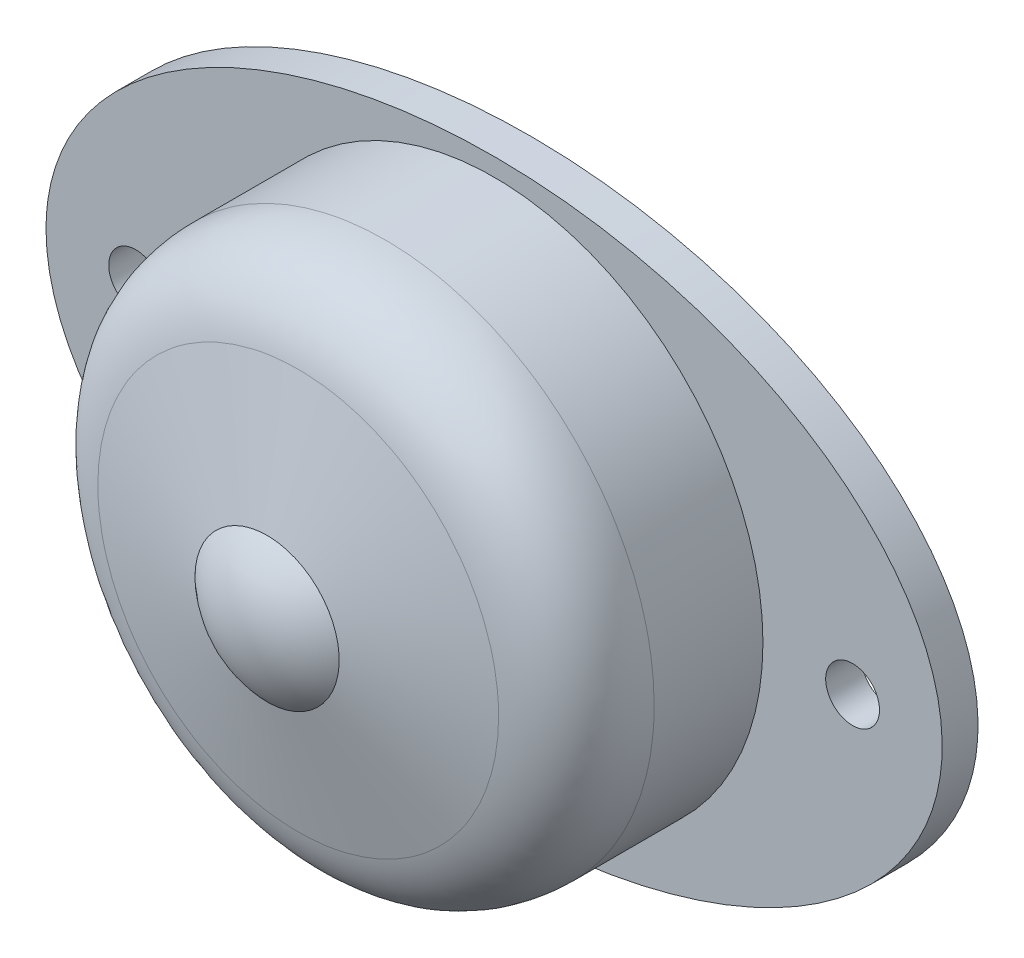
ISO-10303-21;
HEADER;
FILE_DESCRIPTION(('STEP AP214'),'2;1');
FILE_NAME('part.step','',(''),(''),'','','');
FILE_SCHEMA(('AUTOMOTIVE_DESIGN { 1 0 10303 214 1 1 1 1 }'));
ENDSEC;
DATA;
#1=APPLICATION_CONTEXT('core data for automotive mechanical design processes');
#2=APPLICATION_PROTOCOL_DEFINITION('international standard','automotive_design',2000,#1);
#3=PRODUCT_CONTEXT('',#1,'mechanical');
#4=PRODUCT('Part','Part','',(#3));
#5=PRODUCT_RELATED_PRODUCT_CATEGORY('part','',(#4));
#6=PRODUCT_DEFINITION_FORMATION('','',#4);
#7=PRODUCT_DEFINITION_CONTEXT('part definition',#1,'design');
#8=PRODUCT_DEFINITION('design','',#6,#7);
#9=PRODUCT_DEFINITION_SHAPE('','',#8);
#10=(LENGTH_UNIT() NAMED_UNIT(*) SI_UNIT(.MILLI.,.METRE.));
#11=(NAMED_UNIT(*) PLANE_ANGLE_UNIT() SI_UNIT($,.RADIAN.));
#12=(NAMED_UNIT(*) SI_UNIT($,.STERADIAN.) SOLID_ANGLE_UNIT());
#13=UNCERTAINTY_MEASURE_WITH_UNIT(LENGTH_MEASURE(1.E-05),#10,'distance_accuracy_value','');
#14=(GEOMETRIC_REPRESENTATION_CONTEXT(3) GLOBAL_UNCERTAINTY_ASSIGNED_CONTEXT((#13)) GLOBAL_UNIT_ASSIGNED_CONTEXT((#10,
#11,#12)) REPRESENTATION_CONTEXT('',''));
#15=CARTESIAN_POINT('',(0.,0.,0.));
#16=DIRECTION('',(0.,0.,1.));
#17=DIRECTION('',(1.,0.,0.));
#18=AXIS2_PLACEMENT_3D('',#15,#16,#17);
#19=CARTESIAN_POINT('',(0.,0.,10.21559025455));
#20=DIRECTION('',(0.,1.,0.));
#21=DIRECTION('',(0.,0.,-1.));
#22=AXIS2_PLACEMENT_3D('',#19,#20,#21);
#23=SPHERICAL_SURFACE('',#22,6.);
#24=CARTESIAN_POINT('',(0.,6.,10.21559025455));
#25=VERTEX_POINT('',#24);
#26=VERTEX_LOOP('',#25);
#27=FACE_BOUND('',#26,.T.);
#28=ADVANCED_FACE('F64',(#27),#23,.T.);
#29=CLOSED_SHELL('',(#28));
#30=MANIFOLD_SOLID_BREP('B2',#29);
#31=CARTESIAN_POINT('',(0.,0.,2.));
#32=DIRECTION('',(0.,0.,1.));
#33=DIRECTION('',(1.,0.,0.));
#34=AXIS2_PLACEMENT_3D('',#31,#32,#33);
#35=PLANE('',#34);
#36=CARTESIAN_POINT('',(-20.,0.,2.));
#37=DIRECTION('',(0.,0.,1.));
#38=DIRECTION('',(1.,0.,0.));
#39=AXIS2_PLACEMENT_3D('',#36,#37,#38);
#40=CIRCLE('',#39,1.5);
#41=CARTESIAN_POINT('',(-18.5,0.,2.));
#42=VERTEX_POINT('',#41);
#43=EDGE_CURVE('E196',#42,#42,#40,.T.);
#44=ORIENTED_EDGE('',*,*,#43,.F.);
#45=EDGE_LOOP('',(#44));
#46=FACE_BOUND('',#45,.T.);
#47=CARTESIAN_POINT('',(0.,0.,2.));
#48=DIRECTION('',(0.,0.,1.));
#49=DIRECTION('',(-1.,0.,0.));
#50=AXIS2_PLACEMENT_3D('',#47,#48,#49);
#51=ELLIPSE('',#50,25.,16.);
#52=CARTESIAN_POINT('',(-25.,0.,2.));
#53=VERTEX_POINT('',#52);
#54=EDGE_CURVE('E97',#53,#53,#51,.T.);
#55=ORIENTED_EDGE('',*,*,#54,.T.);
#56=EDGE_LOOP('',(#55));
#57=FACE_BOUND('',#56,.T.);
#58=CARTESIAN_POINT('',(0.,0.,2.));
#59=DIRECTION('',(0.,0.,1.));
#60=DIRECTION('',(1.,0.,0.));
#61=AXIS2_PLACEMENT_3D('',#58,#59,#60);
#62=CIRCLE('',#61,15.);
#63=CARTESIAN_POINT('',(15.,0.,2.));
#64=VERTEX_POINT('',#63);
#65=EDGE_CURVE('E107',#64,#64,#62,.T.);
#66=ORIENTED_EDGE('',*,*,#65,.F.);
#67=EDGE_LOOP('',(#66));
#68=FACE_BOUND('',#67,.T.);
#69=CARTESIAN_POINT('',(20.,0.,2.));
#70=DIRECTION('',(0.,0.,1.));
#71=DIRECTION('',(1.,0.,0.));
#72=AXIS2_PLACEMENT_3D('',#69,#70,#71);
#73=CIRCLE('',#72,1.5);
#74=CARTESIAN_POINT('',(21.5,0.,2.));
#75=VERTEX_POINT('',#74);
#76=EDGE_CURVE('E190',#75,#75,#73,.T.);
#77=ORIENTED_EDGE('',*,*,#76,.F.);
#78=EDGE_LOOP('',(#77));
#79=FACE_BOUND('',#78,.T.);
#80=ADVANCED_FACE('F79',(#46,#57,#68,#79),#35,.T.);
#81=CARTESIAN_POINT('',(0.,0.,0.));
#82=DIRECTION('',(0.,0.,1.));
#83=DIRECTION('',(1.,0.,0.));
#84=AXIS2_PLACEMENT_3D('',#81,#82,#83);
#85=PLANE('',#84);
#86=CARTESIAN_POINT('',(0.,0.,0.));
#87=DIRECTION('',(0.,0.,1.));
#88=DIRECTION('',(-1.,0.,0.));
#89=AXIS2_PLACEMENT_3D('',#86,#87,#88);
#90=ELLIPSE('',#89,25.,16.);
#91=CARTESIAN_POINT('',(-25.,0.,0.));
#92=VERTEX_POINT('',#91);
#93=EDGE_CURVE('E102',#92,#92,#90,.T.);
#94=ORIENTED_EDGE('',*,*,#93,.F.);
#95=EDGE_LOOP('',(#94));
#96=FACE_BOUND('',#95,.T.);
#97=CARTESIAN_POINT('',(-20.,0.,0.));
#98=DIRECTION('',(0.,0.,1.));
#99=DIRECTION('',(1.,0.,0.));
#100=AXIS2_PLACEMENT_3D('',#97,#98,#99);
#101=CIRCLE('',#100,1.5);
#102=CARTESIAN_POINT('',(-18.5,0.,0.));
#103=VERTEX_POINT('',#102);
#104=EDGE_CURVE('E193',#103,#103,#101,.T.);
#105=ORIENTED_EDGE('',*,*,#104,.T.);
#106=EDGE_LOOP('',(#105));
#107=FACE_BOUND('',#106,.T.);
#108=CARTESIAN_POINT('',(20.,0.,0.));
#109=DIRECTION('',(0.,0.,1.));
#110=DIRECTION('',(1.,0.,0.));
#111=AXIS2_PLACEMENT_3D('',#108,#109,#110);
#112=CIRCLE('',#111,1.5);
#113=CARTESIAN_POINT('',(21.5,0.,0.));
#114=VERTEX_POINT('',#113);
#115=EDGE_CURVE('E189',#114,#114,#112,.T.);
#116=ORIENTED_EDGE('',*,*,#115,.T.);
#117=EDGE_LOOP('',(#116));
#118=FACE_BOUND('',#117,.T.);
#119=CARTESIAN_POINT('',(0.,0.,0.));
#120=DIRECTION('',(0.,0.,1.));
#121=DIRECTION('',(1.,0.,0.));
#122=AXIS2_PLACEMENT_3D('',#119,#120,#121);
#123=CIRCLE('',#122,7.5);
#124=CARTESIAN_POINT('',(7.5,0.,0.));
#125=VERTEX_POINT('',#124);
#126=EDGE_CURVE('E184',#125,#125,#123,.T.);
#127=ORIENTED_EDGE('',*,*,#126,.T.);
#128=EDGE_LOOP('',(#127));
#129=FACE_BOUND('',#128,.T.);
#130=ADVANCED_FACE('F116',(#96,#107,#118,#129),#85,.F.);
#131=DIRECTION('',(0.,0.,-1.));
#132=VECTOR('',#131,1.);
#133=SURFACE_OF_LINEAR_EXTRUSION('',#51,#132);
#134=ORIENTED_EDGE('',*,*,#54,.F.);
#135=EDGE_LOOP('',(#134));
#136=FACE_BOUND('',#135,.T.);
#137=ORIENTED_EDGE('',*,*,#93,.T.);
#138=EDGE_LOOP('',(#137));
#139=FACE_BOUND('',#138,.T.);
#140=ADVANCED_FACE('F112',(#136,#139),#133,.F.);
#141=CARTESIAN_POINT('',(-20.,0.,2.));
#142=DIRECTION('',(0.,0.,-1.));
#143=DIRECTION('',(-1.,0.,0.));
#144=AXIS2_PLACEMENT_3D('',#141,#142,#143);
#145=CYLINDRICAL_SURFACE('',#144,1.5);
#146=ORIENTED_EDGE('',*,*,#43,.T.);
#147=EDGE_LOOP('',(#146));
#148=FACE_BOUND('',#147,.T.);
#149=ORIENTED_EDGE('',*,*,#104,.F.);
#150=EDGE_LOOP('',(#149));
#151=FACE_BOUND('',#150,.T.);
#152=ADVANCED_FACE('F115',(#148,#151),#145,.F.);
#153=CARTESIAN_POINT('',(20.,0.,2.));
#154=DIRECTION('',(0.,0.,-1.));
#155=DIRECTION('',(-1.,0.,0.));
#156=AXIS2_PLACEMENT_3D('',#153,#154,#155);
#157=CYLINDRICAL_SURFACE('',#156,1.5);
#158=ORIENTED_EDGE('',*,*,#76,.T.);
#159=EDGE_LOOP('',(#158));
#160=FACE_BOUND('',#159,.T.);
#161=ORIENTED_EDGE('',*,*,#115,.F.);
#162=EDGE_LOOP('',(#161));
#163=FACE_BOUND('',#162,.T.);
#164=ADVANCED_FACE('F126',(#160,#163),#157,.F.);
#165=CARTESIAN_POINT('',(0.,0.,12.));
#166=DIRECTION('',(0.,0.,-1.));
#167=DIRECTION('',(-1.,0.,0.));
#168=AXIS2_PLACEMENT_3D('',#165,#166,#167);
#169=CYLINDRICAL_SURFACE('',#168,15.);
#170=CARTESIAN_POINT('',(15.,0.,8.06918918992783));
#171=CARTESIAN_POINT('',(15.,1.96349540522113,8.06918918992783));
#172=CARTESIAN_POINT('',(14.6095901487722,3.92621826841318,8.06918918992783));
#173=CARTESIAN_POINT('',(13.1067958265664,7.55428470253955,8.06918918992783));
#174=CARTESIAN_POINT('',(11.9950026336582,9.21820080193821,8.06918918992783));
#175=CARTESIAN_POINT('',(9.21820080193823,11.9950026336582,8.06918918992783));
#176=CARTESIAN_POINT('',(7.55428470253978,13.1067958265663,8.06918918992783));
#177=CARTESIAN_POINT('',(3.92621826841293,14.6095901487723,8.06918918992783));
#178=CARTESIAN_POINT('',(1.96349540522113,15.,8.06918918992783));
#179=CARTESIAN_POINT('',(-1.96349540522113,15.,8.06918918992783));
#180=CARTESIAN_POINT('',(-3.92621826841332,14.6095901487721,8.06918918992783));
#181=CARTESIAN_POINT('',(-7.55428470253936,13.1067958265665,8.06918918992783));
#182=CARTESIAN_POINT('',(-9.21820080193797,11.9950026336585,8.06918918992783));
#183=CARTESIAN_POINT('',(-11.9950026336585,9.21820080193797,8.06918918992783));
#184=CARTESIAN_POINT('',(-13.1067958265663,7.55428470253985,8.06918918992783));
#185=CARTESIAN_POINT('',(-14.6095901487723,3.92621826841284,8.06918918992783));
#186=CARTESIAN_POINT('',(-15.,1.96349540522124,8.06918918992783));
#187=CARTESIAN_POINT('',(-15.,-1.96349540522124,8.06918918992783));
#188=CARTESIAN_POINT('',(-14.6095901487706,-3.92621826841703,8.06918918992783));
#189=CARTESIAN_POINT('',(-13.106795826568,-7.55428470253566,8.06918918992783));
#190=CARTESIAN_POINT('',(-11.9950026336619,-9.21820080193456,8.06918918992783));
#191=CARTESIAN_POINT('',(-9.21820080193457,-11.9950026336619,8.06918918992783));
#192=CARTESIAN_POINT('',(-7.55428470253687,-13.1067958265675,8.06918918992783));
#193=CARTESIAN_POINT('',(-3.92621826841583,-14.6095901487711,8.06918918992783));
#194=CARTESIAN_POINT('',(-1.9634954052255,-15.,8.06918918992783));
#195=CARTESIAN_POINT('',(1.96349540522548,-15.,8.06918918992783));
#196=CARTESIAN_POINT('',(3.92621826840827,-14.6095901487742,8.06918918992783));
#197=CARTESIAN_POINT('',(7.55428470254447,-13.1067958265644,8.06918918992783));
#198=CARTESIAN_POINT('',(9.21820080193707,-11.9950026336594,8.06918918992783));
#199=CARTESIAN_POINT('',(11.9950026336593,-9.21820080193709,8.06918918992783));
#200=CARTESIAN_POINT('',(13.1067958265664,-7.55428470253952,8.06918918992783));
#201=CARTESIAN_POINT('',(14.6095901487722,-3.92621826841313,8.06918918992783));
#202=CARTESIAN_POINT('',(15.,-1.96349540522113,8.06918918992783));
#203=CARTESIAN_POINT('',(15.,0.,8.06918918992783));
#204=(BOUNDED_CURVE() B_SPLINE_CURVE(3,(#170,#171,#172,#173,#174,#175,#176,#177,#178,#179,#180,
#181,#182,#183,#184,#185,#186,#187,#188,#189,#190,#191,#192,#193,#194,#195,#196,#197,#198,#199,
#200,#201,#202,#203),.UNSPECIFIED.,.T.,.F.) B_SPLINE_CURVE_WITH_KNOTS((4,2,2,2,2,2,2,2,2,2,2,2,
2,2,2,2,4),(-3.14159265358979,-2.74889357189107,-2.35619449019234,-1.96349540849362,
-1.5707963267949,-1.17809724509617,-0.785398163397448,-0.392699081698724,0.,0.392699081698724,
0.785398163397448,1.17809724509617,1.5707963267949,1.96349540849362,2.35619449019234,
2.74889357189107,3.14159265358979),
.UNSPECIFIED.) CURVE() GEOMETRIC_REPRESENTATION_ITEM() RATIONAL_B_SPLINE_CURVE((1.,1.,1.,1.,1.,
1.,1.,1.,1.,1.,1.,1.,1.,1.,1.,1.,1.,1.,1.,1.,1.,1.,1.,1.,1.,1.,1.,1.,1.,1.,1.,1.,1.,1.)) REPRESENTATION_ITEM(''));
#205=CARTESIAN_POINT('',(15.,0.,8.06918918992783));
#206=VERTEX_POINT('',#205);
#207=EDGE_CURVE('E63',#206,#206,#204,.F.);
#208=ORIENTED_EDGE('',*,*,#207,.T.);
#209=EDGE_LOOP('',(#208));
#210=FACE_BOUND('',#209,.T.);
#211=ORIENTED_EDGE('',*,*,#65,.T.);
#212=EDGE_LOOP('',(#211));
#213=FACE_BOUND('',#212,.T.);
#214=ADVANCED_FACE('F130',(#210,#213),#169,.T.);
#215=CARTESIAN_POINT('',(0.,0.,12.));
#216=DIRECTION('',(0.,0.,-1.));
#217=DIRECTION('',(-1.,0.,0.));
#218=AXIS2_PLACEMENT_3D('',#215,#216,#217);
#219=CYLINDRICAL_SURFACE('',#218,7.5);
#220=CARTESIAN_POINT('',(0.,0.,12.));
#221=DIRECTION('',(0.,0.,-1.));
#222=DIRECTION('',(-1.,0.,0.));
#223=AXIS2_PLACEMENT_3D('',#220,#221,#222);
#224=CIRCLE('',#223,7.5);
#225=CARTESIAN_POINT('',(-7.5,0.,12.));
#226=VERTEX_POINT('',#225);
#227=EDGE_CURVE('E181',#226,#226,#224,.T.);
#228=ORIENTED_EDGE('',*,*,#227,.F.);
#229=EDGE_LOOP('',(#228));
#230=FACE_BOUND('',#229,.T.);
#231=ORIENTED_EDGE('',*,*,#126,.F.);
#232=EDGE_LOOP('',(#231));
#233=FACE_BOUND('',#232,.T.);
#234=ADVANCED_FACE('F135',(#230,#233),#219,.F.);
#235=CARTESIAN_POINT('',(0.,0.,14.6663440106518));
#236=DIRECTION('',(0.,0.,-1.));
#237=DIRECTION('',(-1.,0.,0.));
#238=AXIS2_PLACEMENT_3D('',#235,#236,#237);
#239=CONICAL_SURFACE('',#238,4.02377819996895,0.916488867512536);
#240=ORIENTED_EDGE('',*,*,#227,.T.);
#241=EDGE_LOOP('',(#240));
#242=FACE_BOUND('',#241,.T.);
#243=CARTESIAN_POINT('',(0.,0.,14.6663440106518));
#244=DIRECTION('',(0.,0.,-1.));
#245=DIRECTION('',(-1.,0.,0.));
#246=AXIS2_PLACEMENT_3D('',#243,#244,#245);
#247=CIRCLE('',#246,4.02377819996895);
#248=CARTESIAN_POINT('',(-4.02377819996895,0.,14.6663440106518));
#249=VERTEX_POINT('',#248);
#250=EDGE_CURVE('E179',#249,#249,#247,.T.);
#251=ORIENTED_EDGE('',*,*,#250,.F.);
#252=EDGE_LOOP('',(#251));
#253=FACE_BOUND('',#252,.T.);
#254=ADVANCED_FACE('F162',(#242,#253),#239,.F.);
#255=CARTESIAN_POINT('',(0.,0.,12.));
#256=DIRECTION('',(0.,0.,-1.));
#257=DIRECTION('',(-1.,0.,0.));
#258=AXIS2_PLACEMENT_3D('',#255,#256,#257);
#259=CONICAL_SURFACE('',#258,15.,1.33249219498994);
#260=CARTESIAN_POINT('',(11.1802751211296,0.,12.9278876409991));
#261=CARTESIAN_POINT('',(11.1802751211296,-1.46349458862974,12.9278876409991));
#262=CARTESIAN_POINT('',(10.8892824846799,-2.92641336176392,12.9278876409994));
#263=CARTESIAN_POINT('',(9.76917221983374,-5.63059875451586,12.9278876409988));
#264=CARTESIAN_POINT('',(8.94049530153104,-6.87080140583191,12.9278876409993));
#265=CARTESIAN_POINT('',(6.87080140583297,-8.94049530153212,12.9278876409989));
#266=CARTESIAN_POINT('',(5.63059875451928,-9.76917221983091,12.9278876409991));
#267=CARTESIAN_POINT('',(2.92641336176057,-10.8892824846827,12.9278876409991));
#268=CARTESIAN_POINT('',(1.46349458863298,-11.1802751211296,12.9278876409991));
#269=CARTESIAN_POINT('',(-1.463494588633,-11.1802751211296,12.9278876409991));
#270=CARTESIAN_POINT('',(-2.92641336176677,-10.8892824846815,12.9278876409988));
#271=CARTESIAN_POINT('',(-5.63059875451305,-9.76917221983212,12.9278876409994));
#272=CARTESIAN_POINT('',(-6.87080140582957,-8.94049530153444,12.9278876409991));
#273=CARTESIAN_POINT('',(-8.94049530153445,-6.87080140582956,12.9278876409991));
#274=CARTESIAN_POINT('',(-9.7691722198332,-5.63059875451302,12.9278876409992));
#275=CARTESIAN_POINT('',(-10.8892824846804,-2.92641336176679,12.9278876409991));
#276=CARTESIAN_POINT('',(-11.1802751211296,-1.46349458862983,12.9278876409991));
#277=CARTESIAN_POINT('',(-11.1802751211296,1.46349458862983,12.9278876409991));
#278=CARTESIAN_POINT('',(-10.8892824846816,2.92641336176395,12.9278876409991));
#279=CARTESIAN_POINT('',(-9.76917221983206,5.63059875451586,12.9278876409992));
#280=CARTESIAN_POINT('',(-8.94049530153214,6.87080140583294,12.9278876409989));
#281=CARTESIAN_POINT('',(-6.87080140583187,8.94049530153107,12.9278876409993));
#282=CARTESIAN_POINT('',(-5.63059875451586,9.76917221983206,12.9278876409992));
#283=CARTESIAN_POINT('',(-2.92641336176395,10.8892824846816,12.9278876409991));
#284=CARTESIAN_POINT('',(-1.46349458862974,11.1802751211296,12.9278876409991));
#285=CARTESIAN_POINT('',(1.46349458862974,11.1802751211296,12.9278876409991));
#286=CARTESIAN_POINT('',(2.92641336176395,10.8892824846816,12.9278876409991));
#287=CARTESIAN_POINT('',(5.63059875451586,9.76917221983206,12.9278876409992));
#288=CARTESIAN_POINT('',(6.87080140583191,8.94049530153104,12.9278876409993));
#289=CARTESIAN_POINT('',(8.94049530153212,6.87080140583297,12.9278876409989));
#290=CARTESIAN_POINT('',(9.76917221983216,5.63059875451571,12.9278876409992));
#291=CARTESIAN_POINT('',(10.8892824846814,2.92641336176413,12.9278876409991));
#292=CARTESIAN_POINT('',(11.1802751211296,1.46349458862974,12.9278876409991));
#293=CARTESIAN_POINT('',(11.1802751211296,0.,12.9278876409991));
#294=(BOUNDED_CURVE() B_SPLINE_CURVE(3,(#260,#261,#262,#263,#264,#265,#266,#267,#268,#269,#270,
#271,#272,#273,#274,#275,#276,#277,#278,#279,#280,#281,#282,#283,#284,#285,#286,#287,#288,#289,
#290,#291,#292,#293),.UNSPECIFIED.,.T.,.F.) B_SPLINE_CURVE_WITH_KNOTS((4,2,2,2,2,2,2,2,2,2,2,2,
2,2,2,2,4),(-3.14159265358979,-2.74889357189107,-2.35619449019234,-1.96349540849362,
-1.5707963267949,-1.17809724509617,-0.785398163397448,-0.392699081698724,0.,0.392699081698724,
0.785398163397448,1.17809724509617,1.5707963267949,1.96349540849362,2.35619449019234,
2.74889357189107,3.14159265358979),
.UNSPECIFIED.) CURVE() GEOMETRIC_REPRESENTATION_ITEM() RATIONAL_B_SPLINE_CURVE((1.,1.,1.,1.,1.,
1.,1.,1.,1.,1.,1.,1.,1.,1.,1.,1.,1.,1.,1.,1.,1.,1.,1.,1.,1.,1.,1.,1.,1.,1.,1.,1.,1.,1.)) REPRESENTATION_ITEM(''));
#295=CARTESIAN_POINT('',(11.1802751211296,0.,12.9278876409991));
#296=VERTEX_POINT('',#295);
#297=EDGE_CURVE('E92',#296,#296,#294,.F.);
#298=ORIENTED_EDGE('',*,*,#297,.T.);
#299=EDGE_LOOP('',(#298));
#300=FACE_BOUND('',#299,.T.);
#301=ORIENTED_EDGE('',*,*,#250,.T.);
#302=EDGE_LOOP('',(#301));
#303=FACE_BOUND('',#302,.T.);
#304=ADVANCED_FACE('F158',(#300,#303),#259,.T.);
#305=CARTESIAN_POINT('',(15.,0.,8.06918918992783));
#306=CARTESIAN_POINT('',(15.,-1.96349540522113,8.06918918992783));
#307=CARTESIAN_POINT('',(14.6095901487722,-3.92621826841313,8.06918918992783));
#308=CARTESIAN_POINT('',(13.1067958265664,-7.55428470253952,8.06918918992783));
#309=CARTESIAN_POINT('',(11.9950026336593,-9.21820080193709,8.06918918992783));
#310=CARTESIAN_POINT('',(9.21820080193707,-11.9950026336594,8.06918918992783));
#311=CARTESIAN_POINT('',(7.55428470254447,-13.1067958265644,8.06918918992783));
#312=CARTESIAN_POINT('',(3.92621826840827,-14.6095901487742,8.06918918992783));
#313=CARTESIAN_POINT('',(1.96349540522548,-15.,8.06918918992783));
#314=CARTESIAN_POINT('',(-1.9634954052255,-15.,8.06918918992783));
#315=CARTESIAN_POINT('',(-3.92621826841583,-14.6095901487711,8.06918918992783));
#316=CARTESIAN_POINT('',(-7.55428470253687,-13.1067958265675,8.06918918992783));
#317=CARTESIAN_POINT('',(-9.21820080193457,-11.9950026336619,8.06918918992783));
#318=CARTESIAN_POINT('',(-11.9950026336619,-9.21820080193456,8.06918918992783));
#319=CARTESIAN_POINT('',(-13.106795826568,-7.55428470253566,8.06918918992783));
#320=CARTESIAN_POINT('',(-14.6095901487706,-3.92621826841703,8.06918918992783));
#321=CARTESIAN_POINT('',(-15.,-1.96349540522124,8.06918918992783));
#322=CARTESIAN_POINT('',(-15.,1.96349540522124,8.06918918992783));
#323=CARTESIAN_POINT('',(-14.6095901487723,3.92621826841284,8.06918918992783));
#324=CARTESIAN_POINT('',(-13.1067958265663,7.55428470253985,8.06918918992783));
#325=CARTESIAN_POINT('',(-11.9950026336585,9.21820080193797,8.06918918992783));
#326=CARTESIAN_POINT('',(-9.21820080193797,11.9950026336585,8.06918918992783));
#327=CARTESIAN_POINT('',(-7.55428470253936,13.1067958265665,8.06918918992783));
#328=CARTESIAN_POINT('',(-3.92621826841332,14.6095901487721,8.06918918992783));
#329=CARTESIAN_POINT('',(-1.96349540522113,15.,8.06918918992783));
#330=CARTESIAN_POINT('',(1.96349540522113,15.,8.06918918992783));
#331=CARTESIAN_POINT('',(3.92621826841293,14.6095901487723,8.06918918992783));
#332=CARTESIAN_POINT('',(7.55428470253978,13.1067958265663,8.06918918992783));
#333=CARTESIAN_POINT('',(9.21820080193823,11.9950026336582,8.06918918992783));
#334=CARTESIAN_POINT('',(11.9950026336582,9.21820080193821,8.06918918992783));
#335=CARTESIAN_POINT('',(13.1067958265664,7.55428470253955,8.06918918992783));
#336=CARTESIAN_POINT('',(14.6095901487722,3.92621826841318,8.06918918992783));
#337=CARTESIAN_POINT('',(15.,1.96349540522113,8.06918918992783));
#338=CARTESIAN_POINT('',(15.,0.,8.06918918992783));
#339=CARTESIAN_POINT('',(15.,0.,12.));
#340=CARTESIAN_POINT('',(15.,-1.96349540522113,12.));
#341=CARTESIAN_POINT('',(14.6095901487723,-3.92621826841376,12.0000000000034));
#342=CARTESIAN_POINT('',(13.1067958265663,-7.5542847025389,11.9999999999966));
#343=CARTESIAN_POINT('',(11.9950026336582,-9.21820080193595,12.0000000000011));
#344=CARTESIAN_POINT('',(9.21820080193821,-11.9950026336605,11.9999999999989));
#345=CARTESIAN_POINT('',(7.5542847025441,-13.1067958265635,12.0000000000011));
#346=CARTESIAN_POINT('',(3.92621826840864,-14.6095901487751,11.9999999999989));
#347=CARTESIAN_POINT('',(1.96349540522548,-15.0000000000023,12.));
#348=CARTESIAN_POINT('',(-1.9634954052255,-14.9999999999977,12.));
#349=CARTESIAN_POINT('',(-3.92621826841657,-14.6095901487728,12.));
#350=CARTESIAN_POINT('',(-7.55428470253614,-13.1067958265658,12.));
#351=CARTESIAN_POINT('',(-9.21820080193514,-11.9950026336624,11.9999999999989));
#352=CARTESIAN_POINT('',(-11.9950026336613,-9.21820080193399,12.0000000000011));
#353=CARTESIAN_POINT('',(-13.1067958265692,-7.55428470253613,12.));
#354=CARTESIAN_POINT('',(-14.6095901487694,-3.92621826841656,12.));
#355=CARTESIAN_POINT('',(-15.,-1.96349540522124,12.));
#356=CARTESIAN_POINT('',(-15.,1.96349540522124,12.));
#357=CARTESIAN_POINT('',(-14.6095901487717,3.92621826841259,12.));
#358=CARTESIAN_POINT('',(-13.1067958265669,7.55428470254011,12.));
#359=CARTESIAN_POINT('',(-11.995002633659,9.21820080193968,11.9999999999989));
#360=CARTESIAN_POINT('',(-9.2182008019374,11.9950026336568,12.0000000000011));
#361=CARTESIAN_POINT('',(-7.55428470253953,13.1067958265669,12.));
#362=CARTESIAN_POINT('',(-3.92621826841315,14.6095901487717,12.));
#363=CARTESIAN_POINT('',(-1.96349540522113,15.,12.));
#364=CARTESIAN_POINT('',(1.96349540522113,15.,12.));
#365=CARTESIAN_POINT('',(3.92621826841259,14.6095901487728,12.));
#366=CARTESIAN_POINT('',(7.55428470254011,13.1067958265658,12.));
#367=CARTESIAN_POINT('',(9.21820080193709,11.9950026336571,12.0000000000011));
#368=CARTESIAN_POINT('',(11.9950026336594,9.21820080193934,11.9999999999989));
#369=CARTESIAN_POINT('',(13.1067958265674,7.55428470254007,12.));
#370=CARTESIAN_POINT('',(14.6095901487712,3.92621826841266,12.));
#371=CARTESIAN_POINT('',(15.,1.96349540522113,12.));
#372=CARTESIAN_POINT('',(15.,0.,12.));
#373=CARTESIAN_POINT('',(11.1802751211296,0.,12.9278876409991));
#374=CARTESIAN_POINT('',(11.1802751211296,-1.46349458862974,12.9278876409991));
#375=CARTESIAN_POINT('',(10.8892824846799,-2.92641336176392,12.9278876409994));
#376=CARTESIAN_POINT('',(9.76917221983374,-5.63059875451586,12.9278876409988));
#377=CARTESIAN_POINT('',(8.94049530153104,-6.8708014058319,12.9278876409993));
#378=CARTESIAN_POINT('',(6.87080140583296,-8.94049530153212,12.9278876409989));
#379=CARTESIAN_POINT('',(5.63059875451927,-9.76917221983091,12.9278876409991));
#380=CARTESIAN_POINT('',(2.92641336176057,-10.8892824846827,12.9278876409991));
#381=CARTESIAN_POINT('',(1.46349458863298,-11.1802751211296,12.9278876409991));
#382=CARTESIAN_POINT('',(-1.463494588633,-11.1802751211296,12.9278876409991));
#383=CARTESIAN_POINT('',(-2.92641336176677,-10.8892824846815,12.9278876409988));
#384=CARTESIAN_POINT('',(-5.63059875451304,-9.76917221983212,12.9278876409994));
#385=CARTESIAN_POINT('',(-6.87080140582957,-8.94049530153444,12.9278876409991));
#386=CARTESIAN_POINT('',(-8.94049530153445,-6.87080140582956,12.9278876409991));
#387=CARTESIAN_POINT('',(-9.7691722198332,-5.63059875451302,12.9278876409992));
#388=CARTESIAN_POINT('',(-10.8892824846804,-2.92641336176679,12.9278876409991));
#389=CARTESIAN_POINT('',(-11.1802751211296,-1.46349458862983,12.9278876409991));
#390=CARTESIAN_POINT('',(-11.1802751211296,1.46349458862983,12.9278876409991));
#391=CARTESIAN_POINT('',(-10.8892824846815,2.92641336176395,12.9278876409991));
#392=CARTESIAN_POINT('',(-9.76917221983206,5.63059875451586,12.9278876409992));
#393=CARTESIAN_POINT('',(-8.94049530153214,6.87080140583294,12.9278876409989));
#394=CARTESIAN_POINT('',(-6.87080140583187,8.94049530153107,12.9278876409993));
#395=CARTESIAN_POINT('',(-5.63059875451585,9.76917221983206,12.9278876409992));
#396=CARTESIAN_POINT('',(-2.92641336176395,10.8892824846816,12.9278876409991));
#397=CARTESIAN_POINT('',(-1.46349458862974,11.1802751211296,12.9278876409991));
#398=CARTESIAN_POINT('',(1.46349458862974,11.1802751211296,12.9278876409991));
#399=CARTESIAN_POINT('',(2.92641336176395,10.8892824846815,12.9278876409991));
#400=CARTESIAN_POINT('',(5.63059875451586,9.76917221983206,12.9278876409992));
#401=CARTESIAN_POINT('',(6.87080140583191,8.94049530153104,12.9278876409993));
#402=CARTESIAN_POINT('',(8.94049530153212,6.87080140583296,12.9278876409989));
#403=CARTESIAN_POINT('',(9.76917221983216,5.63059875451571,12.9278876409992));
#404=CARTESIAN_POINT('',(10.8892824846814,2.92641336176413,12.9278876409991));
#405=CARTESIAN_POINT('',(11.1802751211296,1.46349458862974,12.9278876409991));
#406=CARTESIAN_POINT('',(11.1802751211296,0.,12.9278876409991));
#407=(BOUNDED_SURFACE() B_SPLINE_SURFACE(2,3,((#305,#306,#307,#308,#309,#310,#311,#312,#313,
#314,#315,#316,#317,#318,#319,#320,#321,#322,#323,#324,#325,#326,#327,#328,#329,#330,#331,#332,
#333,#334,#335,#336,#337,#338),(#339,#340,#341,#342,#343,#344,#345,#346,#347,#348,#349,#350,
#351,#352,#353,#354,#355,#356,#357,#358,#359,#360,#361,#362,#363,#364,#365,#366,#367,#368,#369,
#370,#371,#372),(#373,#374,#375,#376,#377,#378,#379,#380,#381,#382,#383,#384,#385,#386,#387,
#388,#389,#390,#391,#392,#393,#394,#395,#396,#397,#398,#399,#400,#401,#402,#403,#404,#405,
#406)),.UNSPECIFIED.,.F.,.T.,.F.) B_SPLINE_SURFACE_WITH_KNOTS((3,3),(4,2,2,2,2,2,2,2,2,2,2,2,2,
2,2,2,4),(0.,1.),(-3.14159265358979,-2.74889357189107,-2.35619449019234,-1.96349540849362,
-1.5707963267949,-1.17809724509617,-0.785398163397448,-0.392699081698724,0.,0.392699081698724,
0.785398163397448,1.17809724509617,1.5707963267949,1.96349540849362,2.35619449019234,
2.74889357189107,3.14159265358979),
.UNSPECIFIED.) GEOMETRIC_REPRESENTATION_ITEM() RATIONAL_B_SPLINE_SURFACE(((1.,1.,1.,1.,1.,1.,1.,
1.,1.,1.,1.,1.,1.,1.,1.,1.,1.,1.,1.,1.,1.,1.,1.,1.,1.,1.,1.,1.,1.,1.,1.,1.,1.,1.),(1.,1.,1.,1.,
1.,1.,1.,1.,1.,1.,1.,1.,1.,1.,1.,1.,1.,1.,1.,1.,1.,1.,1.,1.,1.,1.,1.,1.,1.,1.,1.,1.,1.,1.),(1.,
1.,1.,1.,1.,1.,1.,1.,1.,1.,1.,1.,1.,1.,1.,1.,1.,1.,1.,1.,1.,1.,1.,1.,1.,1.,1.,1.,1.,1.,1.,1.,1.,1.))) REPRESENTATION_ITEM('') SURFACE());
#408=ORIENTED_EDGE('',*,*,#207,.F.);
#409=EDGE_LOOP('',(#408));
#410=FACE_BOUND('',#409,.T.);
#411=ORIENTED_EDGE('',*,*,#297,.F.);
#412=EDGE_LOOP('',(#411));
#413=FACE_BOUND('',#412,.T.);
#414=ADVANCED_FACE('F82',(#410,#413),#407,.T.);
#415=CLOSED_SHELL('',(#80,#130,#140,#152,#164,#214,#234,#254,#304,#414));
#416=MANIFOLD_SOLID_BREP('B7',#415);
#417=ADVANCED_BREP_SHAPE_REPRESENTATION('',(#18,#30,#416),#14);
#418=SHAPE_DEFINITION_REPRESENTATION(#9,#417);
ENDSEC;
END-ISO-10303-21;
